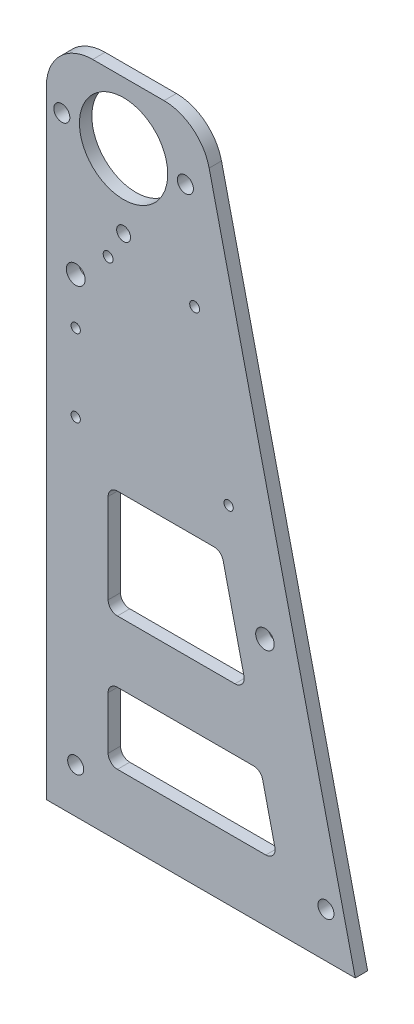
ISO-10303-21;
HEADER;
FILE_DESCRIPTION(('STEP AP214'),'2;1');
FILE_NAME('part.step','',(''),(''),'','','');
FILE_SCHEMA(('AUTOMOTIVE_DESIGN { 1 0 10303 214 1 1 1 1 }'));
ENDSEC;
DATA;
#1=APPLICATION_CONTEXT('core data for automotive mechanical design processes');
#2=APPLICATION_PROTOCOL_DEFINITION('international standard','automotive_design',2000,#1);
#3=PRODUCT_CONTEXT('',#1,'mechanical');
#4=PRODUCT('Part','Part','',(#3));
#5=PRODUCT_RELATED_PRODUCT_CATEGORY('part','',(#4));
#6=PRODUCT_DEFINITION_FORMATION('','',#4);
#7=PRODUCT_DEFINITION_CONTEXT('part definition',#1,'design');
#8=PRODUCT_DEFINITION('design','',#6,#7);
#9=PRODUCT_DEFINITION_SHAPE('','',#8);
#10=(LENGTH_UNIT() NAMED_UNIT(*) SI_UNIT(.MILLI.,.METRE.));
#11=(NAMED_UNIT(*) PLANE_ANGLE_UNIT() SI_UNIT($,.RADIAN.));
#12=(NAMED_UNIT(*) SI_UNIT($,.STERADIAN.) SOLID_ANGLE_UNIT());
#13=UNCERTAINTY_MEASURE_WITH_UNIT(LENGTH_MEASURE(1.E-05),#10,'distance_accuracy_value','');
#14=(GEOMETRIC_REPRESENTATION_CONTEXT(3) GLOBAL_UNCERTAINTY_ASSIGNED_CONTEXT((#13)) GLOBAL_UNIT_ASSIGNED_CONTEXT((#10,
#11,#12)) REPRESENTATION_CONTEXT('',''));
#15=CARTESIAN_POINT('',(0.,0.,0.));
#16=DIRECTION('',(0.,0.,1.));
#17=DIRECTION('',(1.,0.,0.));
#18=AXIS2_PLACEMENT_3D('',#15,#16,#17);
#19=CARTESIAN_POINT('',(0.,0.,4.));
#20=DIRECTION('',(0.,0.,-1.));
#21=DIRECTION('',(-1.,0.,0.));
#22=AXIS2_PLACEMENT_3D('',#19,#20,#21);
#23=PLANE('',#22);
#24=CARTESIAN_POINT('',(70.7598104263352,80.3985552064288,4.));
#25=DIRECTION('',(0.,0.,-1.));
#26=DIRECTION('',(-1.,0.,0.));
#27=AXIS2_PLACEMENT_3D('',#24,#25,#26);
#28=CIRCLE('',#27,3.00000000000001);
#29=CARTESIAN_POINT('',(67.7598104263352,80.3985552064288,4.));
#30=VERTEX_POINT('',#29);
#31=EDGE_CURVE('E741',#30,#30,#28,.T.);
#32=ORIENTED_EDGE('',*,*,#31,.T.);
#33=EDGE_LOOP('',(#32));
#34=FACE_BOUND('',#33,.T.);
#35=CARTESIAN_POINT('',(25.,171.1875,4.));
#36=DIRECTION('',(0.,0.,-1.));
#37=DIRECTION('',(-1.,0.,0.));
#38=AXIS2_PLACEMENT_3D('',#35,#36,#37);
#39=CIRCLE('',#38,2.25);
#40=CARTESIAN_POINT('',(22.75,171.1875,4.));
#41=VERTEX_POINT('',#40);
#42=EDGE_CURVE('E745',#41,#41,#39,.T.);
#43=ORIENTED_EDGE('',*,*,#42,.T.);
#44=EDGE_LOOP('',(#43));
#45=FACE_BOUND('',#44,.T.);
#46=CARTESIAN_POINT('',(20.,162.1875,4.));
#47=DIRECTION('',(0.,0.,-1.));
#48=DIRECTION('',(-1.,0.,0.));
#49=AXIS2_PLACEMENT_3D('',#46,#47,#48);
#50=CIRCLE('',#49,1.59999999999999);
#51=CARTESIAN_POINT('',(18.4,162.1875,4.));
#52=VERTEX_POINT('',#51);
#53=EDGE_CURVE('E755',#52,#52,#50,.T.);
#54=ORIENTED_EDGE('',*,*,#53,.T.);
#55=EDGE_LOOP('',(#54));
#56=FACE_BOUND('',#55,.T.);
#57=CARTESIAN_POINT('',(48.,162.1875,4.));
#58=DIRECTION('',(0.,0.,-1.));
#59=DIRECTION('',(-1.,0.,0.));
#60=AXIS2_PLACEMENT_3D('',#57,#58,#59);
#61=CIRCLE('',#60,1.6);
#62=CARTESIAN_POINT('',(46.4,162.1875,4.));
#63=VERTEX_POINT('',#62);
#64=EDGE_CURVE('E761',#63,#63,#61,.T.);
#65=ORIENTED_EDGE('',*,*,#64,.T.);
#66=EDGE_LOOP('',(#65));
#67=FACE_BOUND('',#66,.T.);
#68=CARTESIAN_POINT('',(45.,195.,4.));
#69=DIRECTION('',(0.,0.,-1.));
#70=DIRECTION('',(-1.,0.,0.));
#71=AXIS2_PLACEMENT_3D('',#68,#69,#70);
#72=CIRCLE('',#71,2.59999999999999);
#73=CARTESIAN_POINT('',(42.4,195.,4.));
#74=VERTEX_POINT('',#73);
#75=EDGE_CURVE('E767',#74,#74,#72,.T.);
#76=ORIENTED_EDGE('',*,*,#75,.T.);
#77=EDGE_LOOP('',(#76));
#78=FACE_BOUND('',#77,.T.);
#79=CARTESIAN_POINT('',(5.,195.,4.));
#80=DIRECTION('',(0.,0.,-1.));
#81=DIRECTION('',(-1.,0.,0.));
#82=AXIS2_PLACEMENT_3D('',#79,#80,#81);
#83=CIRCLE('',#82,2.6);
#84=CARTESIAN_POINT('',(2.4,195.,4.));
#85=VERTEX_POINT('',#84);
#86=EDGE_CURVE('E773',#85,#85,#83,.T.);
#87=ORIENTED_EDGE('',*,*,#86,.T.);
#88=EDGE_LOOP('',(#87));
#89=FACE_BOUND('',#88,.T.);
#90=CARTESIAN_POINT('',(59.,112.,4.));
#91=DIRECTION('',(0.,0.,-1.));
#92=DIRECTION('',(-1.,0.,0.));
#93=AXIS2_PLACEMENT_3D('',#90,#91,#92);
#94=CIRCLE('',#93,1.5);
#95=CARTESIAN_POINT('',(57.5,112.,4.));
#96=VERTEX_POINT('',#95);
#97=EDGE_CURVE('E798',#96,#96,#94,.T.);
#98=ORIENTED_EDGE('',*,*,#97,.T.);
#99=EDGE_LOOP('',(#98));
#100=FACE_BOUND('',#99,.T.);
#101=CARTESIAN_POINT('',(90.4999999999997,14.5,4.));
#102=DIRECTION('',(0.,0.,-1.));
#103=DIRECTION('',(-1.,0.,0.));
#104=AXIS2_PLACEMENT_3D('',#101,#102,#103);
#105=CIRCLE('',#104,2.6);
#106=CARTESIAN_POINT('',(87.8999999999997,14.5,4.));
#107=VERTEX_POINT('',#106);
#108=EDGE_CURVE('E792',#107,#107,#105,.T.);
#109=ORIENTED_EDGE('',*,*,#108,.T.);
#110=EDGE_LOOP('',(#109));
#111=FACE_BOUND('',#110,.T.);
#112=CARTESIAN_POINT('',(9.49999999999998,152.,4.));
#113=DIRECTION('',(0.,0.,-1.));
#114=DIRECTION('',(-1.,0.,0.));
#115=AXIS2_PLACEMENT_3D('',#112,#113,#114);
#116=CIRCLE('',#115,3.05);
#117=CARTESIAN_POINT('',(6.44999999999998,152.,4.));
#118=VERTEX_POINT('',#117);
#119=EDGE_CURVE('E786',#118,#118,#116,.T.);
#120=ORIENTED_EDGE('',*,*,#119,.T.);
#121=EDGE_LOOP('',(#120));
#122=FACE_BOUND('',#121,.T.);
#123=CARTESIAN_POINT('',(9.49999999999998,112.,4.));
#124=DIRECTION('',(0.,0.,-1.));
#125=DIRECTION('',(-1.,0.,0.));
#126=AXIS2_PLACEMENT_3D('',#123,#124,#125);
#127=CIRCLE('',#126,1.5);
#128=CARTESIAN_POINT('',(7.99999999999998,112.,4.));
#129=VERTEX_POINT('',#128);
#130=EDGE_CURVE('E779',#129,#129,#127,.T.);
#131=ORIENTED_EDGE('',*,*,#130,.T.);
#132=EDGE_LOOP('',(#131));
#133=FACE_BOUND('',#132,.T.);
#134=CARTESIAN_POINT('',(9.49999999999998,137.,4.));
#135=DIRECTION('',(0.,0.,-1.));
#136=DIRECTION('',(-1.,0.,0.));
#137=AXIS2_PLACEMENT_3D('',#134,#135,#136);
#138=CIRCLE('',#137,1.5);
#139=CARTESIAN_POINT('',(7.99999999999998,137.,4.));
#140=VERTEX_POINT('',#139);
#141=EDGE_CURVE('E225',#140,#140,#138,.T.);
#142=ORIENTED_EDGE('',*,*,#141,.T.);
#143=EDGE_LOOP('',(#142));
#144=FACE_BOUND('',#143,.T.);
#145=CARTESIAN_POINT('',(67.0839059880551,40.,4.));
#146=DIRECTION('',(0.,0.,1.));
#147=DIRECTION('',(1.,0.,0.));
#148=AXIS2_PLACEMENT_3D('',#145,#146,#147);
#149=CIRCLE('',#148,3.);
#150=CARTESIAN_POINT('',(70.0059300691727,40.6795404839808,4.));
#151=VERTEX_POINT('',#150);
#152=CARTESIAN_POINT('',(67.0839059880551,43.,4.));
#153=VERTEX_POINT('',#152);
#154=EDGE_CURVE('E256',#151,#153,#149,.T.);
#155=ORIENTED_EDGE('',*,*,#154,.F.);
#156=DIRECTION('',(-0.226513494660279,0.974008027039196,0.));
#157=VECTOR('',#156,1.);
#158=CARTESIAN_POINT('',(73.9594184412657,23.6795404839808,4.));
#159=LINE('',#158,#157);
#160=CARTESIAN_POINT('',(73.9594184412657,23.6795404839808,4.));
#161=VERTEX_POINT('',#160);
#162=EDGE_CURVE('E272',#161,#151,#159,.T.);
#163=ORIENTED_EDGE('',*,*,#162,.F.);
#164=CARTESIAN_POINT('',(71.0373943601481,23.,4.));
#165=DIRECTION('',(0.,0.,1.));
#166=DIRECTION('',(1.,0.,0.));
#167=AXIS2_PLACEMENT_3D('',#164,#165,#166);
#168=CIRCLE('',#167,3.00000000000001);
#169=CARTESIAN_POINT('',(71.0373943601481,20.,4.));
#170=VERTEX_POINT('',#169);
#171=EDGE_CURVE('E269',#170,#161,#168,.T.);
#172=ORIENTED_EDGE('',*,*,#171,.F.);
#173=DIRECTION('',(1.,0.,0.));
#174=VECTOR('',#173,1.);
#175=CARTESIAN_POINT('',(23.,20.,4.));
#176=LINE('',#175,#174);
#177=CARTESIAN_POINT('',(23.,20.,4.));
#178=VERTEX_POINT('',#177);
#179=EDGE_CURVE('E267',#178,#170,#176,.T.);
#180=ORIENTED_EDGE('',*,*,#179,.F.);
#181=CARTESIAN_POINT('',(23.,23.,4.));
#182=DIRECTION('',(0.,0.,1.));
#183=DIRECTION('',(1.,0.,0.));
#184=AXIS2_PLACEMENT_3D('',#181,#182,#183);
#185=CIRCLE('',#184,3.);
#186=CARTESIAN_POINT('',(20.,23.,4.));
#187=VERTEX_POINT('',#186);
#188=EDGE_CURVE('E265',#187,#178,#185,.T.);
#189=ORIENTED_EDGE('',*,*,#188,.F.);
#190=DIRECTION('',(0.,-1.,0.));
#191=VECTOR('',#190,1.);
#192=CARTESIAN_POINT('',(20.,40.,4.));
#193=LINE('',#192,#191);
#194=CARTESIAN_POINT('',(20.,40.,4.));
#195=VERTEX_POINT('',#194);
#196=EDGE_CURVE('E263',#195,#187,#193,.T.);
#197=ORIENTED_EDGE('',*,*,#196,.F.);
#198=CARTESIAN_POINT('',(23.,40.,4.));
#199=DIRECTION('',(0.,0.,1.));
#200=DIRECTION('',(-1.,0.,0.));
#201=AXIS2_PLACEMENT_3D('',#198,#199,#200);
#202=CIRCLE('',#201,3.);
#203=CARTESIAN_POINT('',(23.,43.,4.));
#204=VERTEX_POINT('',#203);
#205=EDGE_CURVE('E261',#204,#195,#202,.T.);
#206=ORIENTED_EDGE('',*,*,#205,.F.);
#207=DIRECTION('',(-1.,0.,0.));
#208=VECTOR('',#207,1.);
#209=CARTESIAN_POINT('',(23.,43.,4.));
#210=LINE('',#209,#208);
#211=EDGE_CURVE('E258',#153,#204,#210,.T.);
#212=ORIENTED_EDGE('',*,*,#211,.F.);
#213=EDGE_LOOP('',(#155,#163,#172,#180,#189,#197,#206,#212));
#214=FACE_BOUND('',#213,.T.);
#215=DIRECTION('',(-1.,0.,0.));
#216=VECTOR('',#215,1.);
#217=CARTESIAN_POINT('',(0.,215.,4.));
#218=LINE('',#217,#216);
#219=CARTESIAN_POINT('',(38.0880883339692,215.,4.));
#220=VERTEX_POINT('',#219);
#221=CARTESIAN_POINT('',(15.,215.,4.));
#222=VERTEX_POINT('',#221);
#223=EDGE_CURVE('E333',#220,#222,#218,.T.);
#224=ORIENTED_EDGE('',*,*,#223,.T.);
#225=CARTESIAN_POINT('',(15.,200.,4.));
#226=DIRECTION('',(0.,0.,-1.));
#227=DIRECTION('',(-1.,0.,0.));
#228=AXIS2_PLACEMENT_3D('',#225,#226,#227);
#229=CIRCLE('',#228,15.);
#230=CARTESIAN_POINT('',(0.,200.,4.));
#231=VERTEX_POINT('',#230);
#232=EDGE_CURVE('E41',#222,#231,#229,.F.);
#233=ORIENTED_EDGE('',*,*,#232,.T.);
#234=DIRECTION('',(0.,-1.,0.));
#235=VECTOR('',#234,1.);
#236=CARTESIAN_POINT('',(0.,0.,4.));
#237=LINE('',#236,#235);
#238=CARTESIAN_POINT('',(0.,0.,4.));
#239=VERTEX_POINT('',#238);
#240=EDGE_CURVE('E335',#231,#239,#237,.T.);
#241=ORIENTED_EDGE('',*,*,#240,.T.);
#242=DIRECTION('',(1.,0.,0.));
#243=VECTOR('',#242,1.);
#244=CARTESIAN_POINT('',(100.,0.,4.));
#245=LINE('',#244,#243);
#246=CARTESIAN_POINT('',(100.,0.,4.));
#247=VERTEX_POINT('',#246);
#248=EDGE_CURVE('E327',#239,#247,#245,.T.);
#249=ORIENTED_EDGE('',*,*,#248,.T.);
#250=DIRECTION('',(-0.226513494660278,0.974008027039197,0.));
#251=VECTOR('',#250,1.);
#252=CARTESIAN_POINT('',(50.,215.,4.));
#253=LINE('',#252,#251);
#254=CARTESIAN_POINT('',(52.6982087395572,203.397702419904,4.));
#255=VERTEX_POINT('',#254);
#256=EDGE_CURVE('E330',#247,#255,#253,.T.);
#257=ORIENTED_EDGE('',*,*,#256,.T.);
#258=CARTESIAN_POINT('',(38.0880883339692,200.,4.));
#259=DIRECTION('',(0.,0.,-1.));
#260=DIRECTION('',(-1.,0.,0.));
#261=AXIS2_PLACEMENT_3D('',#258,#259,#260);
#262=CIRCLE('',#261,15.);
#263=EDGE_CURVE('E361',#255,#220,#262,.F.);
#264=ORIENTED_EDGE('',*,*,#263,.T.);
#265=EDGE_LOOP('',(#224,#233,#241,#249,#257,#264));
#266=FACE_BOUND('',#265,.T.);
#267=CARTESIAN_POINT('',(25.,195.,4.));
#268=DIRECTION('',(0.,0.,1.));
#269=DIRECTION('',(1.,0.,0.));
#270=AXIS2_PLACEMENT_3D('',#267,#268,#269);
#271=CIRCLE('',#270,14.2875);
#272=CARTESIAN_POINT('',(39.2875,195.,4.));
#273=VERTEX_POINT('',#272);
#274=EDGE_CURVE('E321',#273,#273,#271,.T.);
#275=ORIENTED_EDGE('',*,*,#274,.F.);
#276=EDGE_LOOP('',(#275));
#277=FACE_BOUND('',#276,.T.);
#278=CARTESIAN_POINT('',(9.5,14.5,4.));
#279=DIRECTION('',(0.,0.,1.));
#280=DIRECTION('',(1.,0.,0.));
#281=AXIS2_PLACEMENT_3D('',#278,#279,#280);
#282=CIRCLE('',#281,2.6);
#283=CARTESIAN_POINT('',(12.1,14.5,4.));
#284=VERTEX_POINT('',#283);
#285=EDGE_CURVE('E315',#284,#284,#282,.T.);
#286=ORIENTED_EDGE('',*,*,#285,.F.);
#287=EDGE_LOOP('',(#286));
#288=FACE_BOUND('',#287,.T.);
#289=CARTESIAN_POINT('',(54.2932083136365,95.,4.));
#290=DIRECTION('',(0.,0.,1.));
#291=DIRECTION('',(1.,0.,0.));
#292=AXIS2_PLACEMENT_3D('',#289,#290,#291);
#293=CIRCLE('',#292,3.);
#294=CARTESIAN_POINT('',(57.2152323947541,95.6795404839808,4.));
#295=VERTEX_POINT('',#294);
#296=CARTESIAN_POINT('',(54.2932083136365,98.,4.));
#297=VERTEX_POINT('',#296);
#298=EDGE_CURVE('E184',#295,#297,#293,.T.);
#299=ORIENTED_EDGE('',*,*,#298,.F.);
#300=DIRECTION('',(-0.226513494660278,0.974008027039196,0.));
#301=VECTOR('',#300,1.);
#302=CARTESIAN_POINT('',(63.9594184412657,66.6795404839808,4.));
#303=LINE('',#302,#301);
#304=CARTESIAN_POINT('',(63.9594184412657,66.6795404839808,4.));
#305=VERTEX_POINT('',#304);
#306=EDGE_CURVE('E221',#305,#295,#303,.T.);
#307=ORIENTED_EDGE('',*,*,#306,.F.);
#308=CARTESIAN_POINT('',(61.0373943601482,66.,4.));
#309=DIRECTION('',(0.,0.,1.));
#310=DIRECTION('',(1.,0.,0.));
#311=AXIS2_PLACEMENT_3D('',#308,#309,#310);
#312=CIRCLE('',#311,3.);
#313=CARTESIAN_POINT('',(61.0373943601482,63.,4.));
#314=VERTEX_POINT('',#313);
#315=EDGE_CURVE('E218',#314,#305,#312,.T.);
#316=ORIENTED_EDGE('',*,*,#315,.F.);
#317=DIRECTION('',(1.,0.,0.));
#318=VECTOR('',#317,1.);
#319=CARTESIAN_POINT('',(23.,63.,4.));
#320=LINE('',#319,#318);
#321=CARTESIAN_POINT('',(23.,63.,4.));
#322=VERTEX_POINT('',#321);
#323=EDGE_CURVE('E216',#322,#314,#320,.T.);
#324=ORIENTED_EDGE('',*,*,#323,.F.);
#325=CARTESIAN_POINT('',(23.,66.,4.));
#326=DIRECTION('',(0.,0.,1.));
#327=DIRECTION('',(1.,0.,0.));
#328=AXIS2_PLACEMENT_3D('',#325,#326,#327);
#329=CIRCLE('',#328,3.00000000000001);
#330=CARTESIAN_POINT('',(20.,66.,4.));
#331=VERTEX_POINT('',#330);
#332=EDGE_CURVE('E214',#331,#322,#329,.T.);
#333=ORIENTED_EDGE('',*,*,#332,.F.);
#334=DIRECTION('',(0.,-1.,0.));
#335=VECTOR('',#334,1.);
#336=CARTESIAN_POINT('',(20.,95.,4.));
#337=LINE('',#336,#335);
#338=CARTESIAN_POINT('',(20.,95.,4.));
#339=VERTEX_POINT('',#338);
#340=EDGE_CURVE('E209',#339,#331,#337,.T.);
#341=ORIENTED_EDGE('',*,*,#340,.F.);
#342=CARTESIAN_POINT('',(23.,95.,4.));
#343=DIRECTION('',(0.,0.,1.));
#344=DIRECTION('',(-1.,0.,0.));
#345=AXIS2_PLACEMENT_3D('',#342,#343,#344);
#346=CIRCLE('',#345,3.);
#347=CARTESIAN_POINT('',(23.,98.,4.));
#348=VERTEX_POINT('',#347);
#349=EDGE_CURVE('E207',#348,#339,#346,.T.);
#350=ORIENTED_EDGE('',*,*,#349,.F.);
#351=DIRECTION('',(-1.,0.,0.));
#352=VECTOR('',#351,1.);
#353=CARTESIAN_POINT('',(54.2932083136365,98.,4.));
#354=LINE('',#353,#352);
#355=EDGE_CURVE('E194',#297,#348,#354,.T.);
#356=ORIENTED_EDGE('',*,*,#355,.F.);
#357=EDGE_LOOP('',(#299,#307,#316,#324,#333,#341,#350,#356));
#358=FACE_BOUND('',#357,.T.);
#359=ADVANCED_FACE('F33',(#34,#45,#56,#67,#78,#89,#100,#111,#122,#133,#144,#214,#266,#277,#288,
#358),#23,.F.);
#360=CARTESIAN_POINT('',(0.,0.,0.));
#361=DIRECTION('',(0.,0.,-1.));
#362=DIRECTION('',(-1.,0.,0.));
#363=AXIS2_PLACEMENT_3D('',#360,#361,#362);
#364=PLANE('',#363);
#365=CARTESIAN_POINT('',(70.7598104263352,80.3985552064288,0.));
#366=DIRECTION('',(0.,0.,-1.));
#367=DIRECTION('',(-1.,0.,0.));
#368=AXIS2_PLACEMENT_3D('',#365,#366,#367);
#369=CIRCLE('',#368,3.00000000000001);
#370=CARTESIAN_POINT('',(67.7598104263352,80.3985552064288,0.));
#371=VERTEX_POINT('',#370);
#372=EDGE_CURVE('E744',#371,#371,#369,.T.);
#373=ORIENTED_EDGE('',*,*,#372,.F.);
#374=EDGE_LOOP('',(#373));
#375=FACE_BOUND('',#374,.T.);
#376=CARTESIAN_POINT('',(25.,171.1875,0.));
#377=DIRECTION('',(0.,0.,-1.));
#378=DIRECTION('',(-1.,0.,0.));
#379=AXIS2_PLACEMENT_3D('',#376,#377,#378);
#380=CIRCLE('',#379,2.25);
#381=CARTESIAN_POINT('',(22.75,171.1875,0.));
#382=VERTEX_POINT('',#381);
#383=EDGE_CURVE('E750',#382,#382,#380,.T.);
#384=ORIENTED_EDGE('',*,*,#383,.F.);
#385=EDGE_LOOP('',(#384));
#386=FACE_BOUND('',#385,.T.);
#387=CARTESIAN_POINT('',(20.,162.1875,0.));
#388=DIRECTION('',(0.,0.,-1.));
#389=DIRECTION('',(-1.,0.,0.));
#390=AXIS2_PLACEMENT_3D('',#387,#388,#389);
#391=CIRCLE('',#390,1.59999999999999);
#392=CARTESIAN_POINT('',(18.4,162.1875,0.));
#393=VERTEX_POINT('',#392);
#394=EDGE_CURVE('E758',#393,#393,#391,.T.);
#395=ORIENTED_EDGE('',*,*,#394,.F.);
#396=EDGE_LOOP('',(#395));
#397=FACE_BOUND('',#396,.T.);
#398=CARTESIAN_POINT('',(48.,162.1875,0.));
#399=DIRECTION('',(0.,0.,-1.));
#400=DIRECTION('',(-1.,0.,0.));
#401=AXIS2_PLACEMENT_3D('',#398,#399,#400);
#402=CIRCLE('',#401,1.6);
#403=CARTESIAN_POINT('',(46.4,162.1875,0.));
#404=VERTEX_POINT('',#403);
#405=EDGE_CURVE('E764',#404,#404,#402,.T.);
#406=ORIENTED_EDGE('',*,*,#405,.F.);
#407=EDGE_LOOP('',(#406));
#408=FACE_BOUND('',#407,.T.);
#409=CARTESIAN_POINT('',(45.,195.,0.));
#410=DIRECTION('',(0.,0.,-1.));
#411=DIRECTION('',(-1.,0.,0.));
#412=AXIS2_PLACEMENT_3D('',#409,#410,#411);
#413=CIRCLE('',#412,2.59999999999999);
#414=CARTESIAN_POINT('',(42.4,195.,0.));
#415=VERTEX_POINT('',#414);
#416=EDGE_CURVE('E770',#415,#415,#413,.T.);
#417=ORIENTED_EDGE('',*,*,#416,.F.);
#418=EDGE_LOOP('',(#417));
#419=FACE_BOUND('',#418,.T.);
#420=CARTESIAN_POINT('',(5.,195.,0.));
#421=DIRECTION('',(0.,0.,-1.));
#422=DIRECTION('',(-1.,0.,0.));
#423=AXIS2_PLACEMENT_3D('',#420,#421,#422);
#424=CIRCLE('',#423,2.6);
#425=CARTESIAN_POINT('',(2.4,195.,0.));
#426=VERTEX_POINT('',#425);
#427=EDGE_CURVE('E776',#426,#426,#424,.T.);
#428=ORIENTED_EDGE('',*,*,#427,.F.);
#429=EDGE_LOOP('',(#428));
#430=FACE_BOUND('',#429,.T.);
#431=CARTESIAN_POINT('',(59.,112.,0.));
#432=DIRECTION('',(0.,0.,-1.));
#433=DIRECTION('',(-1.,0.,0.));
#434=AXIS2_PLACEMENT_3D('',#431,#432,#433);
#435=CIRCLE('',#434,1.5);
#436=CARTESIAN_POINT('',(57.5,112.,0.));
#437=VERTEX_POINT('',#436);
#438=EDGE_CURVE('E747',#437,#437,#435,.T.);
#439=ORIENTED_EDGE('',*,*,#438,.F.);
#440=EDGE_LOOP('',(#439));
#441=FACE_BOUND('',#440,.T.);
#442=CARTESIAN_POINT('',(90.4999999999997,14.5,0.));
#443=DIRECTION('',(0.,0.,-1.));
#444=DIRECTION('',(-1.,0.,0.));
#445=AXIS2_PLACEMENT_3D('',#442,#443,#444);
#446=CIRCLE('',#445,2.6);
#447=CARTESIAN_POINT('',(87.8999999999997,14.5,0.));
#448=VERTEX_POINT('',#447);
#449=EDGE_CURVE('E795',#448,#448,#446,.T.);
#450=ORIENTED_EDGE('',*,*,#449,.F.);
#451=EDGE_LOOP('',(#450));
#452=FACE_BOUND('',#451,.T.);
#453=CARTESIAN_POINT('',(9.49999999999998,152.,0.));
#454=DIRECTION('',(0.,0.,-1.));
#455=DIRECTION('',(-1.,0.,0.));
#456=AXIS2_PLACEMENT_3D('',#453,#454,#455);
#457=CIRCLE('',#456,3.05);
#458=CARTESIAN_POINT('',(6.44999999999998,152.,0.));
#459=VERTEX_POINT('',#458);
#460=EDGE_CURVE('E789',#459,#459,#457,.T.);
#461=ORIENTED_EDGE('',*,*,#460,.F.);
#462=EDGE_LOOP('',(#461));
#463=FACE_BOUND('',#462,.T.);
#464=CARTESIAN_POINT('',(9.49999999999998,112.,0.));
#465=DIRECTION('',(0.,0.,-1.));
#466=DIRECTION('',(-1.,0.,0.));
#467=AXIS2_PLACEMENT_3D('',#464,#465,#466);
#468=CIRCLE('',#467,1.5);
#469=CARTESIAN_POINT('',(7.99999999999998,112.,0.));
#470=VERTEX_POINT('',#469);
#471=EDGE_CURVE('E783',#470,#470,#468,.T.);
#472=ORIENTED_EDGE('',*,*,#471,.F.);
#473=EDGE_LOOP('',(#472));
#474=FACE_BOUND('',#473,.T.);
#475=CARTESIAN_POINT('',(9.49999999999998,137.,0.));
#476=DIRECTION('',(0.,0.,-1.));
#477=DIRECTION('',(-1.,0.,0.));
#478=AXIS2_PLACEMENT_3D('',#475,#476,#477);
#479=CIRCLE('',#478,1.5);
#480=CARTESIAN_POINT('',(7.99999999999998,137.,0.));
#481=VERTEX_POINT('',#480);
#482=EDGE_CURVE('E782',#481,#481,#479,.T.);
#483=ORIENTED_EDGE('',*,*,#482,.F.);
#484=EDGE_LOOP('',(#483));
#485=FACE_BOUND('',#484,.T.);
#486=CARTESIAN_POINT('',(25.,195.,0.));
#487=DIRECTION('',(0.,0.,1.));
#488=DIRECTION('',(1.,0.,0.));
#489=AXIS2_PLACEMENT_3D('',#486,#487,#488);
#490=CIRCLE('',#489,14.2875);
#491=CARTESIAN_POINT('',(39.2875,195.,0.));
#492=VERTEX_POINT('',#491);
#493=EDGE_CURVE('E318',#492,#492,#490,.T.);
#494=ORIENTED_EDGE('',*,*,#493,.T.);
#495=EDGE_LOOP('',(#494));
#496=FACE_BOUND('',#495,.T.);
#497=DIRECTION('',(0.,-1.,0.));
#498=VECTOR('',#497,1.);
#499=CARTESIAN_POINT('',(0.,0.,0.));
#500=LINE('',#499,#498);
#501=CARTESIAN_POINT('',(0.,200.,0.));
#502=VERTEX_POINT('',#501);
#503=CARTESIAN_POINT('',(0.,0.,0.));
#504=VERTEX_POINT('',#503);
#505=EDGE_CURVE('E331',#502,#504,#500,.T.);
#506=ORIENTED_EDGE('',*,*,#505,.F.);
#507=CARTESIAN_POINT('',(15.,200.,0.));
#508=DIRECTION('',(0.,0.,-1.));
#509=DIRECTION('',(-1.,0.,0.));
#510=AXIS2_PLACEMENT_3D('',#507,#508,#509);
#511=CIRCLE('',#510,15.);
#512=CARTESIAN_POINT('',(15.,215.,0.));
#513=VERTEX_POINT('',#512);
#514=EDGE_CURVE('E355',#502,#513,#511,.T.);
#515=ORIENTED_EDGE('',*,*,#514,.T.);
#516=DIRECTION('',(-1.,0.,0.));
#517=VECTOR('',#516,1.);
#518=CARTESIAN_POINT('',(0.,215.,0.));
#519=LINE('',#518,#517);
#520=CARTESIAN_POINT('',(38.0880883339692,215.,0.));
#521=VERTEX_POINT('',#520);
#522=EDGE_CURVE('E342',#521,#513,#519,.T.);
#523=ORIENTED_EDGE('',*,*,#522,.F.);
#524=CARTESIAN_POINT('',(38.0880883339692,200.,0.));
#525=DIRECTION('',(0.,0.,-1.));
#526=DIRECTION('',(-1.,0.,0.));
#527=AXIS2_PLACEMENT_3D('',#524,#525,#526);
#528=CIRCLE('',#527,15.);
#529=CARTESIAN_POINT('',(52.6982087395572,203.397702419904,0.));
#530=VERTEX_POINT('',#529);
#531=EDGE_CURVE('E353',#521,#530,#528,.T.);
#532=ORIENTED_EDGE('',*,*,#531,.T.);
#533=DIRECTION('',(-0.226513494660278,0.974008027039197,0.));
#534=VECTOR('',#533,1.);
#535=CARTESIAN_POINT('',(50.,215.,0.));
#536=LINE('',#535,#534);
#537=CARTESIAN_POINT('',(100.,0.,0.));
#538=VERTEX_POINT('',#537);
#539=EDGE_CURVE('E340',#538,#530,#536,.T.);
#540=ORIENTED_EDGE('',*,*,#539,.F.);
#541=DIRECTION('',(1.,0.,0.));
#542=VECTOR('',#541,1.);
#543=CARTESIAN_POINT('',(100.,0.,0.));
#544=LINE('',#543,#542);
#545=EDGE_CURVE('E324',#504,#538,#544,.T.);
#546=ORIENTED_EDGE('',*,*,#545,.F.);
#547=EDGE_LOOP('',(#506,#515,#523,#532,#540,#546));
#548=FACE_BOUND('',#547,.T.);
#549=CARTESIAN_POINT('',(9.5,14.5,0.));
#550=DIRECTION('',(0.,0.,1.));
#551=DIRECTION('',(1.,0.,0.));
#552=AXIS2_PLACEMENT_3D('',#549,#550,#551);
#553=CIRCLE('',#552,2.6);
#554=CARTESIAN_POINT('',(12.1,14.5,0.));
#555=VERTEX_POINT('',#554);
#556=EDGE_CURVE('E314',#555,#555,#553,.T.);
#557=ORIENTED_EDGE('',*,*,#556,.T.);
#558=EDGE_LOOP('',(#557));
#559=FACE_BOUND('',#558,.T.);
#560=DIRECTION('',(-0.226513494660279,0.974008027039196,0.));
#561=VECTOR('',#560,1.);
#562=CARTESIAN_POINT('',(73.9594184412657,23.6795404839808,0.));
#563=LINE('',#562,#561);
#564=CARTESIAN_POINT('',(73.9594184412657,23.6795404839808,0.));
#565=VERTEX_POINT('',#564);
#566=CARTESIAN_POINT('',(70.0059300691727,40.6795404839808,0.));
#567=VERTEX_POINT('',#566);
#568=EDGE_CURVE('E259',#565,#567,#563,.T.);
#569=ORIENTED_EDGE('',*,*,#568,.T.);
#570=CARTESIAN_POINT('',(67.0839059880551,40.,0.));
#571=DIRECTION('',(0.,0.,1.));
#572=DIRECTION('',(1.,0.,0.));
#573=AXIS2_PLACEMENT_3D('',#570,#571,#572);
#574=CIRCLE('',#573,3.);
#575=CARTESIAN_POINT('',(67.0839059880551,43.,0.));
#576=VERTEX_POINT('',#575);
#577=EDGE_CURVE('E202',#567,#576,#574,.T.);
#578=ORIENTED_EDGE('',*,*,#577,.T.);
#579=DIRECTION('',(-1.,0.,0.));
#580=VECTOR('',#579,1.);
#581=CARTESIAN_POINT('',(23.,43.,0.));
#582=LINE('',#581,#580);
#583=CARTESIAN_POINT('',(23.,43.,0.));
#584=VERTEX_POINT('',#583);
#585=EDGE_CURVE('E277',#576,#584,#582,.T.);
#586=ORIENTED_EDGE('',*,*,#585,.T.);
#587=CARTESIAN_POINT('',(23.,40.,0.));
#588=DIRECTION('',(0.,0.,1.));
#589=DIRECTION('',(-1.,0.,0.));
#590=AXIS2_PLACEMENT_3D('',#587,#588,#589);
#591=CIRCLE('',#590,3.);
#592=CARTESIAN_POINT('',(20.,40.,0.));
#593=VERTEX_POINT('',#592);
#594=EDGE_CURVE('E280',#584,#593,#591,.T.);
#595=ORIENTED_EDGE('',*,*,#594,.T.);
#596=DIRECTION('',(0.,-1.,0.));
#597=VECTOR('',#596,1.);
#598=CARTESIAN_POINT('',(20.,40.,0.));
#599=LINE('',#598,#597);
#600=CARTESIAN_POINT('',(20.,23.,0.));
#601=VERTEX_POINT('',#600);
#602=EDGE_CURVE('E283',#593,#601,#599,.T.);
#603=ORIENTED_EDGE('',*,*,#602,.T.);
#604=CARTESIAN_POINT('',(23.,23.,0.));
#605=DIRECTION('',(0.,0.,1.));
#606=DIRECTION('',(1.,0.,0.));
#607=AXIS2_PLACEMENT_3D('',#604,#605,#606);
#608=CIRCLE('',#607,3.);
#609=CARTESIAN_POINT('',(23.,20.,0.));
#610=VERTEX_POINT('',#609);
#611=EDGE_CURVE('E286',#601,#610,#608,.T.);
#612=ORIENTED_EDGE('',*,*,#611,.T.);
#613=DIRECTION('',(1.,0.,0.));
#614=VECTOR('',#613,1.);
#615=CARTESIAN_POINT('',(23.,20.,0.));
#616=LINE('',#615,#614);
#617=CARTESIAN_POINT('',(71.0373943601481,20.,0.));
#618=VERTEX_POINT('',#617);
#619=EDGE_CURVE('E289',#610,#618,#616,.T.);
#620=ORIENTED_EDGE('',*,*,#619,.T.);
#621=CARTESIAN_POINT('',(71.0373943601481,23.,0.));
#622=DIRECTION('',(0.,0.,1.));
#623=DIRECTION('',(1.,0.,0.));
#624=AXIS2_PLACEMENT_3D('',#621,#622,#623);
#625=CIRCLE('',#624,3.00000000000001);
#626=EDGE_CURVE('E292',#618,#565,#625,.T.);
#627=ORIENTED_EDGE('',*,*,#626,.T.);
#628=EDGE_LOOP('',(#569,#578,#586,#595,#603,#612,#620,#627));
#629=FACE_BOUND('',#628,.T.);
#630=DIRECTION('',(-0.226513494660278,0.974008027039196,0.));
#631=VECTOR('',#630,1.);
#632=CARTESIAN_POINT('',(63.9594184412657,66.6795404839808,0.));
#633=LINE('',#632,#631);
#634=CARTESIAN_POINT('',(63.9594184412657,66.6795404839808,0.));
#635=VERTEX_POINT('',#634);
#636=CARTESIAN_POINT('',(57.2152323947541,95.6795404839808,0.));
#637=VERTEX_POINT('',#636);
#638=EDGE_CURVE('E195',#635,#637,#633,.T.);
#639=ORIENTED_EDGE('',*,*,#638,.T.);
#640=CARTESIAN_POINT('',(54.2932083136365,95.,0.));
#641=DIRECTION('',(0.,0.,1.));
#642=DIRECTION('',(1.,0.,0.));
#643=AXIS2_PLACEMENT_3D('',#640,#641,#642);
#644=CIRCLE('',#643,3.);
#645=CARTESIAN_POINT('',(54.2932083136365,98.,0.));
#646=VERTEX_POINT('',#645);
#647=EDGE_CURVE('E223',#637,#646,#644,.T.);
#648=ORIENTED_EDGE('',*,*,#647,.T.);
#649=DIRECTION('',(-1.,0.,0.));
#650=VECTOR('',#649,1.);
#651=CARTESIAN_POINT('',(54.2932083136365,98.,0.));
#652=LINE('',#651,#650);
#653=CARTESIAN_POINT('',(23.,98.,0.));
#654=VERTEX_POINT('',#653);
#655=EDGE_CURVE('E201',#646,#654,#652,.T.);
#656=ORIENTED_EDGE('',*,*,#655,.T.);
#657=CARTESIAN_POINT('',(23.,95.,0.));
#658=DIRECTION('',(0.,0.,1.));
#659=DIRECTION('',(-1.,0.,0.));
#660=AXIS2_PLACEMENT_3D('',#657,#658,#659);
#661=CIRCLE('',#660,3.);
#662=CARTESIAN_POINT('',(20.,95.,0.));
#663=VERTEX_POINT('',#662);
#664=EDGE_CURVE('E227',#654,#663,#661,.T.);
#665=ORIENTED_EDGE('',*,*,#664,.T.);
#666=DIRECTION('',(0.,-1.,0.));
#667=VECTOR('',#666,1.);
#668=CARTESIAN_POINT('',(20.,95.,0.));
#669=LINE('',#668,#667);
#670=CARTESIAN_POINT('',(20.,66.,0.));
#671=VERTEX_POINT('',#670);
#672=EDGE_CURVE('E230',#663,#671,#669,.T.);
#673=ORIENTED_EDGE('',*,*,#672,.T.);
#674=CARTESIAN_POINT('',(23.,66.,0.));
#675=DIRECTION('',(0.,0.,1.));
#676=DIRECTION('',(1.,0.,0.));
#677=AXIS2_PLACEMENT_3D('',#674,#675,#676);
#678=CIRCLE('',#677,3.00000000000001);
#679=CARTESIAN_POINT('',(23.,63.,0.));
#680=VERTEX_POINT('',#679);
#681=EDGE_CURVE('E233',#671,#680,#678,.T.);
#682=ORIENTED_EDGE('',*,*,#681,.T.);
#683=DIRECTION('',(1.,0.,0.));
#684=VECTOR('',#683,1.);
#685=CARTESIAN_POINT('',(23.,63.,0.));
#686=LINE('',#685,#684);
#687=CARTESIAN_POINT('',(61.0373943601482,63.,0.));
#688=VERTEX_POINT('',#687);
#689=EDGE_CURVE('E236',#680,#688,#686,.T.);
#690=ORIENTED_EDGE('',*,*,#689,.T.);
#691=CARTESIAN_POINT('',(61.0373943601482,66.,0.));
#692=DIRECTION('',(0.,0.,1.));
#693=DIRECTION('',(1.,0.,0.));
#694=AXIS2_PLACEMENT_3D('',#691,#692,#693);
#695=CIRCLE('',#694,3.);
#696=EDGE_CURVE('E239',#688,#635,#695,.T.);
#697=ORIENTED_EDGE('',*,*,#696,.T.);
#698=EDGE_LOOP('',(#639,#648,#656,#665,#673,#682,#690,#697));
#699=FACE_BOUND('',#698,.T.);
#700=ADVANCED_FACE('F376',(#375,#386,#397,#408,#419,#430,#441,#452,#463,#474,#485,#496,#548,
#559,#629,#699),#364,.T.);
#701=CARTESIAN_POINT('',(100.,0.,4.));
#702=DIRECTION('',(0.,1.,0.));
#703=DIRECTION('',(-1.,0.,0.));
#704=AXIS2_PLACEMENT_3D('',#701,#702,#703);
#705=PLANE('',#704);
#706=ORIENTED_EDGE('',*,*,#545,.T.);
#707=DIRECTION('',(0.,0.,-1.));
#708=VECTOR('',#707,1.);
#709=CARTESIAN_POINT('',(100.,0.,4.));
#710=LINE('',#709,#708);
#711=EDGE_CURVE('E347',#247,#538,#710,.T.);
#712=ORIENTED_EDGE('',*,*,#711,.F.);
#713=ORIENTED_EDGE('',*,*,#248,.F.);
#714=DIRECTION('',(0.,0.,-1.));
#715=VECTOR('',#714,1.);
#716=CARTESIAN_POINT('',(0.,0.,4.));
#717=LINE('',#716,#715);
#718=EDGE_CURVE('E337',#239,#504,#717,.T.);
#719=ORIENTED_EDGE('',*,*,#718,.T.);
#720=EDGE_LOOP('',(#706,#712,#713,#719));
#721=FACE_BOUND('',#720,.T.);
#722=ADVANCED_FACE('F386',(#721),#705,.F.);
#723=CARTESIAN_POINT('',(50.,215.,4.));
#724=DIRECTION('',(-0.974008027039197,-0.226513494660278,0.));
#725=DIRECTION('',(0.226513494660278,-0.974008027039197,0.));
#726=AXIS2_PLACEMENT_3D('',#723,#724,#725);
#727=PLANE('',#726);
#728=ORIENTED_EDGE('',*,*,#539,.T.);
#729=DIRECTION('',(0.,0.,-1.));
#730=VECTOR('',#729,1.);
#731=CARTESIAN_POINT('',(52.6982087395572,203.397702419904,4.));
#732=LINE('',#731,#730);
#733=EDGE_CURVE('E11',#530,#255,#732,.F.);
#734=ORIENTED_EDGE('',*,*,#733,.T.);
#735=ORIENTED_EDGE('',*,*,#256,.F.);
#736=ORIENTED_EDGE('',*,*,#711,.T.);
#737=EDGE_LOOP('',(#728,#734,#735,#736));
#738=FACE_BOUND('',#737,.T.);
#739=ADVANCED_FACE('F383',(#738),#727,.F.);
#740=CARTESIAN_POINT('',(0.,215.,4.));
#741=DIRECTION('',(0.,-1.,0.));
#742=DIRECTION('',(0.,0.,-1.));
#743=AXIS2_PLACEMENT_3D('',#740,#741,#742);
#744=PLANE('',#743);
#745=ORIENTED_EDGE('',*,*,#522,.T.);
#746=DIRECTION('',(0.,0.,-1.));
#747=VECTOR('',#746,1.);
#748=CARTESIAN_POINT('',(15.,215.,4.));
#749=LINE('',#748,#747);
#750=EDGE_CURVE('E54',#513,#222,#749,.F.);
#751=ORIENTED_EDGE('',*,*,#750,.T.);
#752=ORIENTED_EDGE('',*,*,#223,.F.);
#753=DIRECTION('',(0.,0.,-1.));
#754=VECTOR('',#753,1.);
#755=CARTESIAN_POINT('',(38.0880883339692,215.,4.));
#756=LINE('',#755,#754);
#757=EDGE_CURVE('E357',#220,#521,#756,.T.);
#758=ORIENTED_EDGE('',*,*,#757,.T.);
#759=EDGE_LOOP('',(#745,#751,#752,#758));
#760=FACE_BOUND('',#759,.T.);
#761=ADVANCED_FACE('F379',(#760),#744,.F.);
#762=CARTESIAN_POINT('',(0.,0.,4.));
#763=DIRECTION('',(1.,0.,0.));
#764=DIRECTION('',(0.,0.,-1.));
#765=AXIS2_PLACEMENT_3D('',#762,#763,#764);
#766=PLANE('',#765);
#767=ORIENTED_EDGE('',*,*,#240,.F.);
#768=DIRECTION('',(0.,0.,-1.));
#769=VECTOR('',#768,1.);
#770=CARTESIAN_POINT('',(0.,200.,4.));
#771=LINE('',#770,#769);
#772=EDGE_CURVE('E350',#231,#502,#771,.T.);
#773=ORIENTED_EDGE('',*,*,#772,.T.);
#774=ORIENTED_EDGE('',*,*,#505,.T.);
#775=ORIENTED_EDGE('',*,*,#718,.F.);
#776=EDGE_LOOP('',(#767,#773,#774,#775));
#777=FACE_BOUND('',#776,.T.);
#778=ADVANCED_FACE('F370',(#777),#766,.F.);
#779=CARTESIAN_POINT('',(25.,195.,4.));
#780=DIRECTION('',(0.,0.,-1.));
#781=DIRECTION('',(-1.,0.,0.));
#782=AXIS2_PLACEMENT_3D('',#779,#780,#781);
#783=CYLINDRICAL_SURFACE('',#782,14.2875);
#784=ORIENTED_EDGE('',*,*,#274,.T.);
#785=EDGE_LOOP('',(#784));
#786=FACE_BOUND('',#785,.T.);
#787=ORIENTED_EDGE('',*,*,#493,.F.);
#788=EDGE_LOOP('',(#787));
#789=FACE_BOUND('',#788,.T.);
#790=ADVANCED_FACE('F404',(#786,#789),#783,.F.);
#791=CARTESIAN_POINT('',(9.5,14.5,4.));
#792=DIRECTION('',(0.,0.,-1.));
#793=DIRECTION('',(-1.,0.,0.));
#794=AXIS2_PLACEMENT_3D('',#791,#792,#793);
#795=CYLINDRICAL_SURFACE('',#794,2.6);
#796=ORIENTED_EDGE('',*,*,#285,.T.);
#797=EDGE_LOOP('',(#796));
#798=FACE_BOUND('',#797,.T.);
#799=ORIENTED_EDGE('',*,*,#556,.F.);
#800=EDGE_LOOP('',(#799));
#801=FACE_BOUND('',#800,.T.);
#802=ADVANCED_FACE('F425',(#798,#801),#795,.F.);
#803=CARTESIAN_POINT('',(67.0839059880551,40.,4.));
#804=DIRECTION('',(0.,0.,-1.));
#805=DIRECTION('',(-1.,0.,0.));
#806=AXIS2_PLACEMENT_3D('',#803,#804,#805);
#807=CYLINDRICAL_SURFACE('',#806,3.);
#808=ORIENTED_EDGE('',*,*,#577,.F.);
#809=DIRECTION('',(0.,0.,-1.));
#810=VECTOR('',#809,1.);
#811=CARTESIAN_POINT('',(70.0059300691727,40.6795404839808,4.));
#812=LINE('',#811,#810);
#813=EDGE_CURVE('E274',#151,#567,#812,.T.);
#814=ORIENTED_EDGE('',*,*,#813,.F.);
#815=ORIENTED_EDGE('',*,*,#154,.T.);
#816=DIRECTION('',(0.,0.,-1.));
#817=VECTOR('',#816,1.);
#818=CARTESIAN_POINT('',(67.0839059880551,43.,4.));
#819=LINE('',#818,#817);
#820=EDGE_CURVE('E311',#153,#576,#819,.T.);
#821=ORIENTED_EDGE('',*,*,#820,.T.);
#822=EDGE_LOOP('',(#808,#814,#815,#821));
#823=FACE_BOUND('',#822,.T.);
#824=ADVANCED_FACE('F432',(#823),#807,.F.);
#825=CARTESIAN_POINT('',(23.,43.,4.));
#826=DIRECTION('',(0.,-1.,0.));
#827=DIRECTION('',(0.,0.,-1.));
#828=AXIS2_PLACEMENT_3D('',#825,#826,#827);
#829=PLANE('',#828);
#830=ORIENTED_EDGE('',*,*,#585,.F.);
#831=ORIENTED_EDGE('',*,*,#820,.F.);
#832=ORIENTED_EDGE('',*,*,#211,.T.);
#833=DIRECTION('',(0.,0.,-1.));
#834=VECTOR('',#833,1.);
#835=CARTESIAN_POINT('',(23.,43.,4.));
#836=LINE('',#835,#834);
#837=EDGE_CURVE('E309',#204,#584,#836,.T.);
#838=ORIENTED_EDGE('',*,*,#837,.T.);
#839=EDGE_LOOP('',(#830,#831,#832,#838));
#840=FACE_BOUND('',#839,.T.);
#841=ADVANCED_FACE('F439',(#840),#829,.T.);
#842=CARTESIAN_POINT('',(23.,40.,4.));
#843=DIRECTION('',(0.,0.,-1.));
#844=DIRECTION('',(-1.,0.,0.));
#845=AXIS2_PLACEMENT_3D('',#842,#843,#844);
#846=CYLINDRICAL_SURFACE('',#845,3.);
#847=ORIENTED_EDGE('',*,*,#594,.F.);
#848=ORIENTED_EDGE('',*,*,#837,.F.);
#849=ORIENTED_EDGE('',*,*,#205,.T.);
#850=DIRECTION('',(0.,0.,-1.));
#851=VECTOR('',#850,1.);
#852=CARTESIAN_POINT('',(20.,40.,4.));
#853=LINE('',#852,#851);
#854=EDGE_CURVE('E307',#195,#593,#853,.T.);
#855=ORIENTED_EDGE('',*,*,#854,.T.);
#856=EDGE_LOOP('',(#847,#848,#849,#855));
#857=FACE_BOUND('',#856,.T.);
#858=ADVANCED_FACE('F447',(#857),#846,.F.);
#859=CARTESIAN_POINT('',(20.,40.,4.));
#860=DIRECTION('',(1.,0.,0.));
#861=DIRECTION('',(0.,1.,0.));
#862=AXIS2_PLACEMENT_3D('',#859,#860,#861);
#863=PLANE('',#862);
#864=ORIENTED_EDGE('',*,*,#602,.F.);
#865=ORIENTED_EDGE('',*,*,#854,.F.);
#866=ORIENTED_EDGE('',*,*,#196,.T.);
#867=DIRECTION('',(0.,0.,-1.));
#868=VECTOR('',#867,1.);
#869=CARTESIAN_POINT('',(20.,23.,4.));
#870=LINE('',#869,#868);
#871=EDGE_CURVE('E305',#187,#601,#870,.T.);
#872=ORIENTED_EDGE('',*,*,#871,.T.);
#873=EDGE_LOOP('',(#864,#865,#866,#872));
#874=FACE_BOUND('',#873,.T.);
#875=ADVANCED_FACE('F455',(#874),#863,.T.);
#876=CARTESIAN_POINT('',(23.,23.,4.));
#877=DIRECTION('',(0.,0.,-1.));
#878=DIRECTION('',(-1.,0.,0.));
#879=AXIS2_PLACEMENT_3D('',#876,#877,#878);
#880=CYLINDRICAL_SURFACE('',#879,3.);
#881=ORIENTED_EDGE('',*,*,#611,.F.);
#882=ORIENTED_EDGE('',*,*,#871,.F.);
#883=ORIENTED_EDGE('',*,*,#188,.T.);
#884=DIRECTION('',(0.,0.,-1.));
#885=VECTOR('',#884,1.);
#886=CARTESIAN_POINT('',(23.,20.,4.));
#887=LINE('',#886,#885);
#888=EDGE_CURVE('E303',#178,#610,#887,.T.);
#889=ORIENTED_EDGE('',*,*,#888,.T.);
#890=EDGE_LOOP('',(#881,#882,#883,#889));
#891=FACE_BOUND('',#890,.T.);
#892=ADVANCED_FACE('F463',(#891),#880,.F.);
#893=CARTESIAN_POINT('',(23.,20.,4.));
#894=DIRECTION('',(0.,1.,0.));
#895=DIRECTION('',(-1.,0.,0.));
#896=AXIS2_PLACEMENT_3D('',#893,#894,#895);
#897=PLANE('',#896);
#898=ORIENTED_EDGE('',*,*,#619,.F.);
#899=ORIENTED_EDGE('',*,*,#888,.F.);
#900=ORIENTED_EDGE('',*,*,#179,.T.);
#901=DIRECTION('',(0.,0.,-1.));
#902=VECTOR('',#901,1.);
#903=CARTESIAN_POINT('',(71.0373943601481,20.,4.));
#904=LINE('',#903,#902);
#905=EDGE_CURVE('E301',#170,#618,#904,.T.);
#906=ORIENTED_EDGE('',*,*,#905,.T.);
#907=EDGE_LOOP('',(#898,#899,#900,#906));
#908=FACE_BOUND('',#907,.T.);
#909=ADVANCED_FACE('F471',(#908),#897,.T.);
#910=CARTESIAN_POINT('',(71.0373943601481,23.,4.));
#911=DIRECTION('',(0.,0.,-1.));
#912=DIRECTION('',(-1.,0.,0.));
#913=AXIS2_PLACEMENT_3D('',#910,#911,#912);
#914=CYLINDRICAL_SURFACE('',#913,3.00000000000001);
#915=ORIENTED_EDGE('',*,*,#626,.F.);
#916=ORIENTED_EDGE('',*,*,#905,.F.);
#917=ORIENTED_EDGE('',*,*,#171,.T.);
#918=DIRECTION('',(0.,0.,-1.));
#919=VECTOR('',#918,1.);
#920=CARTESIAN_POINT('',(73.9594184412657,23.6795404839808,4.));
#921=LINE('',#920,#919);
#922=EDGE_CURVE('E299',#161,#565,#921,.T.);
#923=ORIENTED_EDGE('',*,*,#922,.T.);
#924=EDGE_LOOP('',(#915,#916,#917,#923));
#925=FACE_BOUND('',#924,.T.);
#926=ADVANCED_FACE('F479',(#925),#914,.F.);
#927=CARTESIAN_POINT('',(73.9594184412657,23.6795404839808,4.));
#928=DIRECTION('',(-0.974008027039196,-0.226513494660279,0.));
#929=DIRECTION('',(0.226513494660279,-0.974008027039196,0.));
#930=AXIS2_PLACEMENT_3D('',#927,#928,#929);
#931=PLANE('',#930);
#932=ORIENTED_EDGE('',*,*,#568,.F.);
#933=ORIENTED_EDGE('',*,*,#922,.F.);
#934=ORIENTED_EDGE('',*,*,#162,.T.);
#935=ORIENTED_EDGE('',*,*,#813,.T.);
#936=EDGE_LOOP('',(#932,#933,#934,#935));
#937=FACE_BOUND('',#936,.T.);
#938=ADVANCED_FACE('F487',(#937),#931,.T.);
#939=CARTESIAN_POINT('',(54.2932083136365,95.,4.));
#940=DIRECTION('',(0.,0.,-1.));
#941=DIRECTION('',(-1.,0.,0.));
#942=AXIS2_PLACEMENT_3D('',#939,#940,#941);
#943=CYLINDRICAL_SURFACE('',#942,3.);
#944=ORIENTED_EDGE('',*,*,#647,.F.);
#945=DIRECTION('',(0.,0.,-1.));
#946=VECTOR('',#945,1.);
#947=CARTESIAN_POINT('',(57.2152323947541,95.6795404839808,4.));
#948=LINE('',#947,#946);
#949=EDGE_CURVE('E190',#295,#637,#948,.T.);
#950=ORIENTED_EDGE('',*,*,#949,.F.);
#951=ORIENTED_EDGE('',*,*,#298,.T.);
#952=DIRECTION('',(0.,0.,-1.));
#953=VECTOR('',#952,1.);
#954=CARTESIAN_POINT('',(54.2932083136365,98.,4.));
#955=LINE('',#954,#953);
#956=EDGE_CURVE('E187',#297,#646,#955,.T.);
#957=ORIENTED_EDGE('',*,*,#956,.T.);
#958=EDGE_LOOP('',(#944,#950,#951,#957));
#959=FACE_BOUND('',#958,.T.);
#960=ADVANCED_FACE('F186',(#959),#943,.F.);
#961=CARTESIAN_POINT('',(54.2932083136365,98.,4.));
#962=DIRECTION('',(0.,-1.,0.));
#963=DIRECTION('',(1.,0.,0.));
#964=AXIS2_PLACEMENT_3D('',#961,#962,#963);
#965=PLANE('',#964);
#966=ORIENTED_EDGE('',*,*,#655,.F.);
#967=ORIENTED_EDGE('',*,*,#956,.F.);
#968=ORIENTED_EDGE('',*,*,#355,.T.);
#969=DIRECTION('',(0.,0.,-1.));
#970=VECTOR('',#969,1.);
#971=CARTESIAN_POINT('',(23.,98.,4.));
#972=LINE('',#971,#970);
#973=EDGE_CURVE('E203',#348,#654,#972,.T.);
#974=ORIENTED_EDGE('',*,*,#973,.T.);
#975=EDGE_LOOP('',(#966,#967,#968,#974));
#976=FACE_BOUND('',#975,.T.);
#977=ADVANCED_FACE('F198',(#976),#965,.T.);
#978=CARTESIAN_POINT('',(23.,95.,4.));
#979=DIRECTION('',(0.,0.,-1.));
#980=DIRECTION('',(-1.,0.,0.));
#981=AXIS2_PLACEMENT_3D('',#978,#979,#980);
#982=CYLINDRICAL_SURFACE('',#981,3.);
#983=ORIENTED_EDGE('',*,*,#664,.F.);
#984=ORIENTED_EDGE('',*,*,#973,.F.);
#985=ORIENTED_EDGE('',*,*,#349,.T.);
#986=DIRECTION('',(0.,0.,-1.));
#987=VECTOR('',#986,1.);
#988=CARTESIAN_POINT('',(20.,95.,4.));
#989=LINE('',#988,#987);
#990=EDGE_CURVE('E253',#339,#663,#989,.T.);
#991=ORIENTED_EDGE('',*,*,#990,.T.);
#992=EDGE_LOOP('',(#983,#984,#985,#991));
#993=FACE_BOUND('',#992,.T.);
#994=ADVANCED_FACE('F508',(#993),#982,.F.);
#995=CARTESIAN_POINT('',(20.,95.,4.));
#996=DIRECTION('',(1.,0.,0.));
#997=DIRECTION('',(0.,1.,0.));
#998=AXIS2_PLACEMENT_3D('',#995,#996,#997);
#999=PLANE('',#998);
#1000=ORIENTED_EDGE('',*,*,#672,.F.);
#1001=ORIENTED_EDGE('',*,*,#990,.F.);
#1002=ORIENTED_EDGE('',*,*,#340,.T.);
#1003=DIRECTION('',(0.,0.,-1.));
#1004=VECTOR('',#1003,1.);
#1005=CARTESIAN_POINT('',(20.,66.,4.));
#1006=LINE('',#1005,#1004);
#1007=EDGE_CURVE('E251',#331,#671,#1006,.T.);
#1008=ORIENTED_EDGE('',*,*,#1007,.T.);
#1009=EDGE_LOOP('',(#1000,#1001,#1002,#1008));
#1010=FACE_BOUND('',#1009,.T.);
#1011=ADVANCED_FACE('F515',(#1010),#999,.T.);
#1012=CARTESIAN_POINT('',(23.,66.,4.));
#1013=DIRECTION('',(0.,0.,-1.));
#1014=DIRECTION('',(-1.,0.,0.));
#1015=AXIS2_PLACEMENT_3D('',#1012,#1013,#1014);
#1016=CYLINDRICAL_SURFACE('',#1015,3.00000000000001);
#1017=ORIENTED_EDGE('',*,*,#681,.F.);
#1018=ORIENTED_EDGE('',*,*,#1007,.F.);
#1019=ORIENTED_EDGE('',*,*,#332,.T.);
#1020=DIRECTION('',(0.,0.,-1.));
#1021=VECTOR('',#1020,1.);
#1022=CARTESIAN_POINT('',(23.,63.,4.));
#1023=LINE('',#1022,#1021);
#1024=EDGE_CURVE('E249',#322,#680,#1023,.T.);
#1025=ORIENTED_EDGE('',*,*,#1024,.T.);
#1026=EDGE_LOOP('',(#1017,#1018,#1019,#1025));
#1027=FACE_BOUND('',#1026,.T.);
#1028=ADVANCED_FACE('F523',(#1027),#1016,.F.);
#1029=CARTESIAN_POINT('',(23.,63.,4.));
#1030=DIRECTION('',(0.,1.,0.));
#1031=DIRECTION('',(0.,0.,1.));
#1032=AXIS2_PLACEMENT_3D('',#1029,#1030,#1031);
#1033=PLANE('',#1032);
#1034=ORIENTED_EDGE('',*,*,#689,.F.);
#1035=ORIENTED_EDGE('',*,*,#1024,.F.);
#1036=ORIENTED_EDGE('',*,*,#323,.T.);
#1037=DIRECTION('',(0.,0.,-1.));
#1038=VECTOR('',#1037,1.);
#1039=CARTESIAN_POINT('',(61.0373943601482,63.,4.));
#1040=LINE('',#1039,#1038);
#1041=EDGE_CURVE('E247',#314,#688,#1040,.T.);
#1042=ORIENTED_EDGE('',*,*,#1041,.T.);
#1043=EDGE_LOOP('',(#1034,#1035,#1036,#1042));
#1044=FACE_BOUND('',#1043,.T.);
#1045=ADVANCED_FACE('F531',(#1044),#1033,.T.);
#1046=CARTESIAN_POINT('',(61.0373943601482,66.,4.));
#1047=DIRECTION('',(0.,0.,-1.));
#1048=DIRECTION('',(-1.,0.,0.));
#1049=AXIS2_PLACEMENT_3D('',#1046,#1047,#1048);
#1050=CYLINDRICAL_SURFACE('',#1049,3.);
#1051=ORIENTED_EDGE('',*,*,#696,.F.);
#1052=ORIENTED_EDGE('',*,*,#1041,.F.);
#1053=ORIENTED_EDGE('',*,*,#315,.T.);
#1054=DIRECTION('',(0.,0.,-1.));
#1055=VECTOR('',#1054,1.);
#1056=CARTESIAN_POINT('',(63.9594184412657,66.6795404839808,4.));
#1057=LINE('',#1056,#1055);
#1058=EDGE_CURVE('E245',#305,#635,#1057,.T.);
#1059=ORIENTED_EDGE('',*,*,#1058,.T.);
#1060=EDGE_LOOP('',(#1051,#1052,#1053,#1059));
#1061=FACE_BOUND('',#1060,.T.);
#1062=ADVANCED_FACE('F539',(#1061),#1050,.F.);
#1063=CARTESIAN_POINT('',(63.9594184412657,66.6795404839808,4.));
#1064=DIRECTION('',(-0.974008027039196,-0.226513494660279,0.));
#1065=DIRECTION('',(0.226513494660279,-0.974008027039196,0.));
#1066=AXIS2_PLACEMENT_3D('',#1063,#1064,#1065);
#1067=PLANE('',#1066);
#1068=ORIENTED_EDGE('',*,*,#638,.F.);
#1069=ORIENTED_EDGE('',*,*,#1058,.F.);
#1070=ORIENTED_EDGE('',*,*,#306,.T.);
#1071=ORIENTED_EDGE('',*,*,#949,.T.);
#1072=EDGE_LOOP('',(#1068,#1069,#1070,#1071));
#1073=FACE_BOUND('',#1072,.T.);
#1074=ADVANCED_FACE('F547',(#1073),#1067,.T.);
#1075=CARTESIAN_POINT('',(15.,200.,4.));
#1076=DIRECTION('',(0.,0.,-1.));
#1077=DIRECTION('',(-1.,0.,0.));
#1078=AXIS2_PLACEMENT_3D('',#1075,#1076,#1077);
#1079=CYLINDRICAL_SURFACE('',#1078,15.);
#1080=ORIENTED_EDGE('',*,*,#232,.F.);
#1081=ORIENTED_EDGE('',*,*,#750,.F.);
#1082=ORIENTED_EDGE('',*,*,#514,.F.);
#1083=ORIENTED_EDGE('',*,*,#772,.F.);
#1084=EDGE_LOOP('',(#1080,#1081,#1082,#1083));
#1085=FACE_BOUND('',#1084,.T.);
#1086=ADVANCED_FACE('F373',(#1085),#1079,.T.);
#1087=CARTESIAN_POINT('',(38.0880883339692,200.,4.));
#1088=DIRECTION('',(0.,0.,-1.));
#1089=DIRECTION('',(-1.,0.,0.));
#1090=AXIS2_PLACEMENT_3D('',#1087,#1088,#1089);
#1091=CYLINDRICAL_SURFACE('',#1090,15.);
#1092=ORIENTED_EDGE('',*,*,#263,.F.);
#1093=ORIENTED_EDGE('',*,*,#733,.F.);
#1094=ORIENTED_EDGE('',*,*,#531,.F.);
#1095=ORIENTED_EDGE('',*,*,#757,.F.);
#1096=EDGE_LOOP('',(#1092,#1093,#1094,#1095));
#1097=FACE_BOUND('',#1096,.T.);
#1098=ADVANCED_FACE('F35',(#1097),#1091,.T.);
#1099=CARTESIAN_POINT('',(9.49999999999998,137.,4.));
#1100=DIRECTION('',(0.,0.,-1.));
#1101=DIRECTION('',(-1.,0.,0.));
#1102=AXIS2_PLACEMENT_3D('',#1099,#1100,#1101);
#1103=CYLINDRICAL_SURFACE('',#1102,1.5);
#1104=ORIENTED_EDGE('',*,*,#141,.F.);
#1105=EDGE_LOOP('',(#1104));
#1106=FACE_BOUND('',#1105,.T.);
#1107=ORIENTED_EDGE('',*,*,#482,.T.);
#1108=EDGE_LOOP('',(#1107));
#1109=FACE_BOUND('',#1108,.T.);
#1110=ADVANCED_FACE('F566',(#1106,#1109),#1103,.F.);
#1111=CARTESIAN_POINT('',(9.49999999999998,112.,4.));
#1112=DIRECTION('',(0.,0.,-1.));
#1113=DIRECTION('',(-1.,0.,0.));
#1114=AXIS2_PLACEMENT_3D('',#1111,#1112,#1113);
#1115=CYLINDRICAL_SURFACE('',#1114,1.5);
#1116=ORIENTED_EDGE('',*,*,#130,.F.);
#1117=EDGE_LOOP('',(#1116));
#1118=FACE_BOUND('',#1117,.T.);
#1119=ORIENTED_EDGE('',*,*,#471,.T.);
#1120=EDGE_LOOP('',(#1119));
#1121=FACE_BOUND('',#1120,.T.);
#1122=ADVANCED_FACE('F572',(#1118,#1121),#1115,.F.);
#1123=CARTESIAN_POINT('',(9.49999999999998,152.,4.));
#1124=DIRECTION('',(0.,0.,-1.));
#1125=DIRECTION('',(-1.,0.,0.));
#1126=AXIS2_PLACEMENT_3D('',#1123,#1124,#1125);
#1127=CYLINDRICAL_SURFACE('',#1126,3.05);
#1128=ORIENTED_EDGE('',*,*,#119,.F.);
#1129=EDGE_LOOP('',(#1128));
#1130=FACE_BOUND('',#1129,.T.);
#1131=ORIENTED_EDGE('',*,*,#460,.T.);
#1132=EDGE_LOOP('',(#1131));
#1133=FACE_BOUND('',#1132,.T.);
#1134=ADVANCED_FACE('F580',(#1130,#1133),#1127,.F.);
#1135=CARTESIAN_POINT('',(90.4999999999997,14.5,4.));
#1136=DIRECTION('',(0.,0.,-1.));
#1137=DIRECTION('',(-1.,0.,0.));
#1138=AXIS2_PLACEMENT_3D('',#1135,#1136,#1137);
#1139=CYLINDRICAL_SURFACE('',#1138,2.6);
#1140=ORIENTED_EDGE('',*,*,#108,.F.);
#1141=EDGE_LOOP('',(#1140));
#1142=FACE_BOUND('',#1141,.T.);
#1143=ORIENTED_EDGE('',*,*,#449,.T.);
#1144=EDGE_LOOP('',(#1143));
#1145=FACE_BOUND('',#1144,.T.);
#1146=ADVANCED_FACE('F588',(#1142,#1145),#1139,.F.);
#1147=CARTESIAN_POINT('',(59.,112.,4.));
#1148=DIRECTION('',(0.,0.,-1.));
#1149=DIRECTION('',(-1.,0.,0.));
#1150=AXIS2_PLACEMENT_3D('',#1147,#1148,#1149);
#1151=CYLINDRICAL_SURFACE('',#1150,1.5);
#1152=ORIENTED_EDGE('',*,*,#97,.F.);
#1153=EDGE_LOOP('',(#1152));
#1154=FACE_BOUND('',#1153,.T.);
#1155=ORIENTED_EDGE('',*,*,#438,.T.);
#1156=EDGE_LOOP('',(#1155));
#1157=FACE_BOUND('',#1156,.T.);
#1158=ADVANCED_FACE('F596',(#1154,#1157),#1151,.F.);
#1159=CARTESIAN_POINT('',(5.,195.,4.));
#1160=DIRECTION('',(0.,0.,-1.));
#1161=DIRECTION('',(-1.,0.,0.));
#1162=AXIS2_PLACEMENT_3D('',#1159,#1160,#1161);
#1163=CYLINDRICAL_SURFACE('',#1162,2.6);
#1164=ORIENTED_EDGE('',*,*,#86,.F.);
#1165=EDGE_LOOP('',(#1164));
#1166=FACE_BOUND('',#1165,.T.);
#1167=ORIENTED_EDGE('',*,*,#427,.T.);
#1168=EDGE_LOOP('',(#1167));
#1169=FACE_BOUND('',#1168,.T.);
#1170=ADVANCED_FACE('F604',(#1166,#1169),#1163,.F.);
#1171=CARTESIAN_POINT('',(45.,195.,4.));
#1172=DIRECTION('',(0.,0.,-1.));
#1173=DIRECTION('',(-1.,0.,0.));
#1174=AXIS2_PLACEMENT_3D('',#1171,#1172,#1173);
#1175=CYLINDRICAL_SURFACE('',#1174,2.59999999999999);
#1176=ORIENTED_EDGE('',*,*,#75,.F.);
#1177=EDGE_LOOP('',(#1176));
#1178=FACE_BOUND('',#1177,.T.);
#1179=ORIENTED_EDGE('',*,*,#416,.T.);
#1180=EDGE_LOOP('',(#1179));
#1181=FACE_BOUND('',#1180,.T.);
#1182=ADVANCED_FACE('F612',(#1178,#1181),#1175,.F.);
#1183=CARTESIAN_POINT('',(48.,162.1875,4.));
#1184=DIRECTION('',(0.,0.,-1.));
#1185=DIRECTION('',(-1.,0.,0.));
#1186=AXIS2_PLACEMENT_3D('',#1183,#1184,#1185);
#1187=CYLINDRICAL_SURFACE('',#1186,1.6);
#1188=ORIENTED_EDGE('',*,*,#64,.F.);
#1189=EDGE_LOOP('',(#1188));
#1190=FACE_BOUND('',#1189,.T.);
#1191=ORIENTED_EDGE('',*,*,#405,.T.);
#1192=EDGE_LOOP('',(#1191));
#1193=FACE_BOUND('',#1192,.T.);
#1194=ADVANCED_FACE('F621',(#1190,#1193),#1187,.F.);
#1195=CARTESIAN_POINT('',(20.,162.1875,4.));
#1196=DIRECTION('',(0.,0.,-1.));
#1197=DIRECTION('',(-1.,0.,0.));
#1198=AXIS2_PLACEMENT_3D('',#1195,#1196,#1197);
#1199=CYLINDRICAL_SURFACE('',#1198,1.59999999999999);
#1200=ORIENTED_EDGE('',*,*,#53,.F.);
#1201=EDGE_LOOP('',(#1200));
#1202=FACE_BOUND('',#1201,.T.);
#1203=ORIENTED_EDGE('',*,*,#394,.T.);
#1204=EDGE_LOOP('',(#1203));
#1205=FACE_BOUND('',#1204,.T.);
#1206=ADVANCED_FACE('F629',(#1202,#1205),#1199,.F.);
#1207=CARTESIAN_POINT('',(25.,171.1875,4.));
#1208=DIRECTION('',(0.,0.,-1.));
#1209=DIRECTION('',(-1.,0.,0.));
#1210=AXIS2_PLACEMENT_3D('',#1207,#1208,#1209);
#1211=CYLINDRICAL_SURFACE('',#1210,2.25);
#1212=ORIENTED_EDGE('',*,*,#42,.F.);
#1213=EDGE_LOOP('',(#1212));
#1214=FACE_BOUND('',#1213,.T.);
#1215=ORIENTED_EDGE('',*,*,#383,.T.);
#1216=EDGE_LOOP('',(#1215));
#1217=FACE_BOUND('',#1216,.T.);
#1218=ADVANCED_FACE('F637',(#1214,#1217),#1211,.F.);
#1219=CARTESIAN_POINT('',(70.7598104263352,80.3985552064288,4.));
#1220=DIRECTION('',(0.,0.,-1.));
#1221=DIRECTION('',(-1.,0.,0.));
#1222=AXIS2_PLACEMENT_3D('',#1219,#1220,#1221);
#1223=CYLINDRICAL_SURFACE('',#1222,3.00000000000001);
#1224=ORIENTED_EDGE('',*,*,#31,.F.);
#1225=EDGE_LOOP('',(#1224));
#1226=FACE_BOUND('',#1225,.T.);
#1227=ORIENTED_EDGE('',*,*,#372,.T.);
#1228=EDGE_LOOP('',(#1227));
#1229=FACE_BOUND('',#1228,.T.);
#1230=ADVANCED_FACE('F645',(#1226,#1229),#1223,.F.);
#1231=CLOSED_SHELL('',(#359,#700,#722,#739,#761,#778,#790,#802,#824,#841,#858,#875,#892,#909,
#926,#938,#960,#977,#994,#1011,#1028,#1045,#1062,#1074,#1086,#1098,#1110,#1122,#1134,#1146,
#1158,#1170,#1182,#1194,#1206,#1218,#1230));
#1232=MANIFOLD_SOLID_BREP('B2',#1231);
#1233=ADVANCED_BREP_SHAPE_REPRESENTATION('',(#18,#1232),#14);
#1234=SHAPE_DEFINITION_REPRESENTATION(#9,#1233);
ENDSEC;
END-ISO-10303-21;
